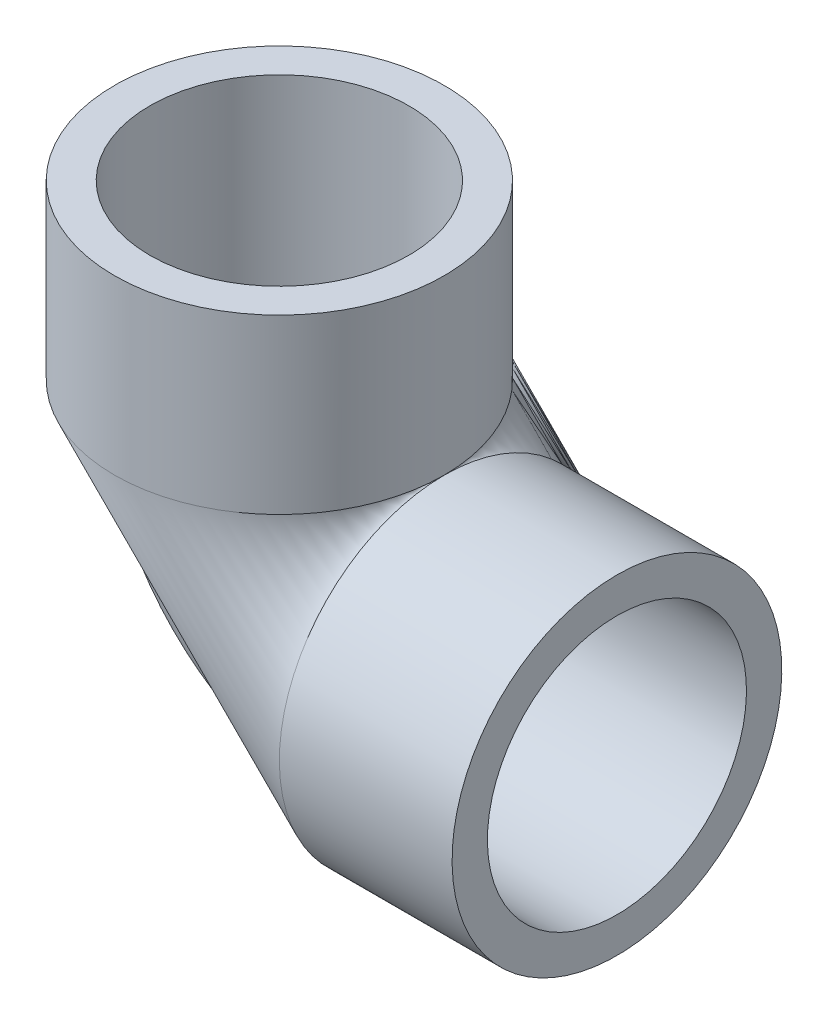
ISO-10303-21;
HEADER;
FILE_DESCRIPTION(('STEP AP214'),'2;1');
FILE_NAME('part.step','',(''),(''),'','','');
FILE_SCHEMA(('AUTOMOTIVE_DESIGN { 1 0 10303 214 1 1 1 1 }'));
ENDSEC;
DATA;
#1=APPLICATION_CONTEXT('core data for automotive mechanical design processes');
#2=APPLICATION_PROTOCOL_DEFINITION('international standard','automotive_design',2000,#1);
#3=PRODUCT_CONTEXT('',#1,'mechanical');
#4=PRODUCT('Part','Part','',(#3));
#5=PRODUCT_RELATED_PRODUCT_CATEGORY('part','',(#4));
#6=PRODUCT_DEFINITION_FORMATION('','',#4);
#7=PRODUCT_DEFINITION_CONTEXT('part definition',#1,'design');
#8=PRODUCT_DEFINITION('design','',#6,#7);
#9=PRODUCT_DEFINITION_SHAPE('','',#8);
#10=(LENGTH_UNIT() NAMED_UNIT(*) SI_UNIT(.MILLI.,.METRE.));
#11=(NAMED_UNIT(*) PLANE_ANGLE_UNIT() SI_UNIT($,.RADIAN.));
#12=(NAMED_UNIT(*) SI_UNIT($,.STERADIAN.) SOLID_ANGLE_UNIT());
#13=UNCERTAINTY_MEASURE_WITH_UNIT(LENGTH_MEASURE(1.E-05),#10,'distance_accuracy_value','');
#14=(GEOMETRIC_REPRESENTATION_CONTEXT(3) GLOBAL_UNCERTAINTY_ASSIGNED_CONTEXT((#13)) GLOBAL_UNIT_ASSIGNED_CONTEXT((#10,
#11,#12)) REPRESENTATION_CONTEXT('',''));
#15=CARTESIAN_POINT('',(0.,0.,0.));
#16=DIRECTION('',(0.,0.,1.));
#17=DIRECTION('',(1.,0.,0.));
#18=AXIS2_PLACEMENT_3D('',#15,#16,#17);
#19=CARTESIAN_POINT('',(16.66875,-17.4625,0.));
#20=DIRECTION('',(0.,0.,1.));
#21=DIRECTION('',(1.,0.,0.));
#22=AXIS2_PLACEMENT_3D('',#19,#20,#21);
#23=TOROIDAL_SURFACE('',#22,16.66875,12.7);
#24=CARTESIAN_POINT('',(15.08125,-43.0626561830387,-8.9799317743288));
#25=CARTESIAN_POINT('',(15.08125,-42.809587008464,-9.23253720698957));
#26=CARTESIAN_POINT('',(15.08125,-42.5458718412618,-9.47442334524002));
#27=CARTESIAN_POINT('',(15.08125,-41.9989016005629,-9.93518223296435));
#28=CARTESIAN_POINT('',(15.08125,-41.7156411904807,-10.1540486556861));
#29=CARTESIAN_POINT('',(15.08125,-41.1313614668476,-10.5673577395072));
#30=CARTESIAN_POINT('',(15.08125,-40.8303226990876,-10.7617728884659));
#31=CARTESIAN_POINT('',(15.08125,-40.2129249938863,-11.1245294798165));
#32=CARTESIAN_POINT('',(15.08125,-39.8965660753375,-11.2928709543608));
#33=CARTESIAN_POINT('',(15.08125,-39.2509901428096,-11.6022051928326));
#34=CARTESIAN_POINT('',(15.08125,-38.9217811821697,-11.7432147657227));
#35=CARTESIAN_POINT('',(15.08125,-38.2526626394665,-11.9970398339399));
#36=CARTESIAN_POINT('',(15.08125,-37.9127528876756,-12.1098548818135));
#37=CARTESIAN_POINT('',(15.08125,-37.2247491891379,-12.3064902637684));
#38=CARTESIAN_POINT('',(15.08125,-36.8766575029687,-12.3903185083149));
#39=CARTESIAN_POINT('',(15.08125,-36.1746687416269,-12.5284644774771));
#40=CARTESIAN_POINT('',(15.08125,-35.8207716788133,-12.5827822649083));
#41=CARTESIAN_POINT('',(15.08125,-35.1087916178865,-12.6616620589225));
#42=CARTESIAN_POINT('',(15.08125,-34.750700435262,-12.6861501838495));
#43=CARTESIAN_POINT('',(15.08125,-34.0337271470964,-12.7049994763203));
#44=CARTESIAN_POINT('',(15.08125,-33.6748450402634,-12.6993605946173));
#45=CARTESIAN_POINT('',(15.08125,-32.95879051547,-12.6580487120037));
#46=CARTESIAN_POINT('',(15.08125,-32.6016182158085,-12.6223736622985));
#47=CARTESIAN_POINT('',(15.08125,-31.8915054022052,-12.5212998109258));
#48=CARTESIAN_POINT('',(15.08125,-31.538564905032,-12.4559008915168));
#49=CARTESIAN_POINT('',(15.08125,-30.8373404175716,-12.2954431849074));
#50=CARTESIAN_POINT('',(15.08125,-30.4890952277944,-12.2002148353084));
#51=CARTESIAN_POINT('',(15.08125,-29.8017892690921,-11.9809730397868));
#52=CARTESIAN_POINT('',(15.08125,-29.4627285232792,-11.8569595214358));
#53=CARTESIAN_POINT('',(15.08125,-28.7961408578277,-11.581109046127));
#54=CARTESIAN_POINT('',(15.08125,-28.468613431296,-11.4292733137888));
#55=CARTESIAN_POINT('',(15.08125,-27.8273026625447,-11.0989236809953));
#56=CARTESIAN_POINT('',(15.08125,-27.5135194170695,-10.9204095927918));
#57=CARTESIAN_POINT('',(15.08125,-26.8986564275992,-10.5360647249099));
#58=CARTESIAN_POINT('',(15.08125,-26.597740370763,-10.32997207491));
#59=CARTESIAN_POINT('',(15.08125,-26.0141144966661,-9.89344849600062));
#60=CARTESIAN_POINT('',(15.08125,-25.7314048039978,-9.66301740056342));
#61=CARTESIAN_POINT('',(15.08125,-25.1860588979013,-9.17948339048945));
#62=CARTESIAN_POINT('',(15.08125,-24.9234239901319,-8.92637900350908));
#63=CARTESIAN_POINT('',(15.08125,-24.4198972289138,-8.39921436303733));
#64=CARTESIAN_POINT('',(15.08125,-24.1790137018831,-8.12514615813704));
#65=CARTESIAN_POINT('',(15.08125,-23.7174185998298,-7.55394079906333));
#66=CARTESIAN_POINT('',(15.08125,-23.497048093995,-7.25652792282));
#67=CARTESIAN_POINT('',(15.08125,-23.0820831202526,-6.64423380267808));
#68=CARTESIAN_POINT('',(15.08125,-22.8874884345808,-6.32935270638958));
#69=CARTESIAN_POINT('',(15.08125,-22.5256343936779,-5.68419356779112));
#70=CARTESIAN_POINT('',(15.08125,-22.3583785179188,-5.35391357249282));
#71=CARTESIAN_POINT('',(15.08125,-22.0528448437,-4.68013943111232));
#72=CARTESIAN_POINT('',(15.08125,-21.9145708931291,-4.33664353753058));
#73=CARTESIAN_POINT('',(15.08125,-21.6695664357953,-3.64110699955026));
#74=CARTESIAN_POINT('',(15.08125,-21.5626336565383,-3.28913776115465));
#75=CARTESIAN_POINT('',(15.08125,-21.3808720079995,-2.57716169280524));
#76=CARTESIAN_POINT('',(15.08125,-21.3060270698222,-2.21715898109142));
#77=CARTESIAN_POINT('',(15.08125,-21.1899769663406,-1.49207553894225));
#78=CARTESIAN_POINT('',(15.08125,-21.1487419960512,-1.1269996002809));
#79=CARTESIAN_POINT('',(15.08125,-21.1008420470706,-0.394598453556225));
#80=CARTESIAN_POINT('',(15.08125,-21.0941737505169,-0.0272734647553036));
#81=CARTESIAN_POINT('',(15.08125,-21.1146927222672,0.676257441163889));
#82=CARTESIAN_POINT('',(15.08125,-21.1391500335384,1.01254643867464));
#83=CARTESIAN_POINT('',(15.08125,-21.2167844936315,1.68177510969918));
#84=CARTESIAN_POINT('',(15.08125,-21.2699607483635,2.01471488715358));
#85=CARTESIAN_POINT('',(15.08125,-21.4040310162699,2.67511092727373));
#86=CARTESIAN_POINT('',(15.08125,-21.484938466339,3.00256445079884));
#87=CARTESIAN_POINT('',(15.08125,-21.6732145716112,3.64988968270588));
#88=CARTESIAN_POINT('',(15.08125,-21.780593401426,3.96975842383695));
#89=CARTESIAN_POINT('',(15.08125,-22.0210429610087,4.60145317329528));
#90=CARTESIAN_POINT('',(15.08125,-22.1542359505165,4.91323256892134));
#91=CARTESIAN_POINT('',(15.08125,-22.4446640736736,5.52536255521346));
#92=CARTESIAN_POINT('',(15.08125,-22.6018986406503,5.8257134150477));
#93=CARTESIAN_POINT('',(15.08125,-22.9391902081227,6.41336188266581));
#94=CARTESIAN_POINT('',(15.08125,-23.119250198626,6.70065777360897));
#95=CARTESIAN_POINT('',(15.08125,-23.5009005432906,7.26044970458331));
#96=CARTESIAN_POINT('',(15.08125,-23.7024851108321,7.5329496927437));
#97=CARTESIAN_POINT('',(15.08125,-24.1433565636834,8.0833342574544));
#98=CARTESIAN_POINT('',(15.08125,-24.3843792392686,8.35983099168014));
#99=CARTESIAN_POINT('',(15.08125,-24.8885961963402,8.8918277649966));
#100=CARTESIAN_POINT('',(15.08125,-25.1517915751838,9.14732676364304));
#101=CARTESIAN_POINT('',(15.08125,-25.6986119759426,9.6355101202471));
#102=CARTESIAN_POINT('',(15.08125,-25.9822392624644,9.86819194245294));
#103=CARTESIAN_POINT('',(15.08125,-26.5679807153731,10.3089873660632));
#104=CARTESIAN_POINT('',(15.08125,-26.8700947153243,10.5171011886037));
#105=CARTESIAN_POINT('',(15.08125,-27.4937520578878,10.9090801073777));
#106=CARTESIAN_POINT('',(15.08125,-27.8154548358405,11.0926916657536));
#107=CARTESIAN_POINT('',(15.08125,-28.4733427436701,11.431837077057));
#108=CARTESIAN_POINT('',(15.08125,-28.8095280577718,11.5873705726876));
#109=CARTESIAN_POINT('',(15.08125,-29.493964127133,11.8691153606071));
#110=CARTESIAN_POINT('',(15.08125,-29.8422146377745,11.9953272469827));
#111=CARTESIAN_POINT('',(15.08125,-30.5482590695898,12.2174067869833));
#112=CARTESIAN_POINT('',(15.08125,-30.9060528557442,12.3132748696689));
#113=CARTESIAN_POINT('',(15.08125,-31.6234300704678,12.4727318779431));
#114=CARTESIAN_POINT('',(15.08125,-31.9829159803262,12.5367597384026));
#115=CARTESIAN_POINT('',(15.08125,-32.7060306213315,12.6340187391734));
#116=CARTESIAN_POINT('',(15.08125,-33.0696593199472,12.6672501211442));
#117=CARTESIAN_POINT('',(15.08125,-33.7984068824514,12.7026090438298));
#118=CARTESIAN_POINT('',(15.08125,-34.1635256634836,12.7047382910314));
#119=CARTESIAN_POINT('',(15.08125,-34.8926131111404,12.6778251595594));
#120=CARTESIAN_POINT('',(15.08125,-35.256581784579,12.6487829659135));
#121=CARTESIAN_POINT('',(15.08125,-35.976810637392,12.5601708237403));
#122=CARTESIAN_POINT('',(15.08125,-36.3331116223972,12.5009322834569));
#123=CARTESIAN_POINT('',(15.08125,-37.039417167778,12.3524969973218));
#124=CARTESIAN_POINT('',(15.08125,-37.3894217745538,12.2633004723365));
#125=CARTESIAN_POINT('',(15.08125,-38.0806011079605,12.0555595844257));
#126=CARTESIAN_POINT('',(15.08125,-38.421776058755,11.9370159673611));
#127=CARTESIAN_POINT('',(15.08125,-39.0928369345746,11.6714056287885));
#128=CARTESIAN_POINT('',(15.08125,-39.4227228877308,11.5243389783631));
#129=CARTESIAN_POINT('',(15.08125,-40.0668752881791,11.203686191107));
#130=CARTESIAN_POINT('',(15.08125,-40.3812235188121,11.0302643254194));
#131=CARTESIAN_POINT('',(15.08125,-40.9941457330656,10.6574853032463));
#132=CARTESIAN_POINT('',(15.08125,-41.2927197844294,10.4581282581538));
#133=CARTESIAN_POINT('',(15.08125,-41.8719441286315,10.0348920819217));
#134=CARTESIAN_POINT('',(15.08125,-42.1525946594305,9.81101327645123));
#135=CARTESIAN_POINT('',(15.08125,-42.6939564474244,9.34032215930848));
#136=CARTESIAN_POINT('',(15.08125,-42.9546677296624,9.09350987644088));
#137=CARTESIAN_POINT('',(15.08125,-43.4534618754714,8.57954696291266));
#138=CARTESIAN_POINT('',(15.08125,-43.6916153844931,8.31246488881601));
#139=CARTESIAN_POINT('',(15.08125,-44.1445398708572,7.75916051079744));
#140=CARTESIAN_POINT('',(15.08125,-44.3593109029295,7.47293825167836));
#141=CARTESIAN_POINT('',(15.08125,-44.7639298500392,6.88339074190881));
#142=CARTESIAN_POINT('',(15.08125,-44.9537779039727,6.58006558658649));
#143=CARTESIAN_POINT('',(15.08125,-45.3071904816392,5.95847137339124));
#144=CARTESIAN_POINT('',(15.08125,-45.4707550229594,5.6402023255179));
#145=CARTESIAN_POINT('',(15.08125,-45.7701701264878,4.99154612740584));
#146=CARTESIAN_POINT('',(15.08125,-45.9060676432381,4.66118065015975));
#147=CARTESIAN_POINT('',(15.08125,-46.1495270041285,3.99016890381088));
#148=CARTESIAN_POINT('',(15.08125,-46.2570888786481,3.64952264573082));
#149=CARTESIAN_POINT('',(15.08125,-46.4431030847105,2.96038915396448));
#150=CARTESIAN_POINT('',(15.08125,-46.5215567093532,2.6119022693185));
#151=CARTESIAN_POINT('',(15.08125,-46.6487995294992,1.90955456110286));
#152=CARTESIAN_POINT('',(15.08125,-46.6975887637502,1.55569374455328));
#153=CARTESIAN_POINT('',(15.08125,-46.765122070229,0.845450999405052));
#154=CARTESIAN_POINT('',(15.08125,-46.7838942106239,0.489071739375971));
#155=CARTESIAN_POINT('',(15.08125,-46.7913470388221,-0.224002552382375));
#156=CARTESIAN_POINT('',(15.08125,-46.7800276252273,-0.580697585171637));
#157=CARTESIAN_POINT('',(15.08125,-46.7273711031264,-1.29195843086824));
#158=CARTESIAN_POINT('',(15.08125,-46.686026187863,-1.64652366584048));
#159=CARTESIAN_POINT('',(15.08125,-46.5736064964687,-2.35090316472964));
#160=CARTESIAN_POINT('',(15.08125,-46.5025322022483,-2.70071750556323));
#161=CARTESIAN_POINT('',(15.08125,-46.3311348279911,-3.39322180932631));
#162=CARTESIAN_POINT('',(15.08125,-46.2308026455208,-3.73590951948788));
#163=CARTESIAN_POINT('',(15.08125,-46.0016162107847,-4.4116105683407));
#164=CARTESIAN_POINT('',(15.08125,-45.8727618551343,-4.74462387196005));
#165=CARTESIAN_POINT('',(15.08125,-45.5876057739772,-5.39825180099275));
#166=CARTESIAN_POINT('',(15.08125,-45.431334497108,-5.71887970432928));
#167=CARTESIAN_POINT('',(15.08125,-45.0924245878567,-6.34574750429641));
#168=CARTESIAN_POINT('',(15.08125,-44.9097930930489,-6.65199126607475));
#169=CARTESIAN_POINT('',(15.08125,-44.4751902699158,-7.31554718286444));
#170=CARTESIAN_POINT('',(15.08125,-44.2168805071797,-7.66873086755303));
#171=CARTESIAN_POINT('',(15.08125,-43.6652311992463,-8.34658875251484));
#172=CARTESIAN_POINT('',(15.08125,-43.3718916626315,-8.67126295977298));
#173=CARTESIAN_POINT('',(15.08125,-43.0626561830387,-8.9799317743288));
#174=B_SPLINE_CURVE_WITH_KNOTS('',3,(#24,#25,#26,#27,#28,#29,#30,#31,#32,#33,#34,#35,#36,#37,
#38,#39,#40,#41,#42,#43,#44,#45,#46,#47,#48,#49,#50,#51,#52,#53,#54,#55,#56,#57,#58,#59,#60,#61,
#62,#63,#64,#65,#66,#67,#68,#69,#70,#71,#72,#73,#74,#75,#76,#77,#78,#79,#80,#81,#82,#83,#84,#85,
#86,#87,#88,#89,#90,#91,#92,#93,#94,#95,#96,#97,#98,#99,#100,#101,#102,#103,#104,#105,#106,#107,
#108,#109,#110,#111,#112,#113,#114,#115,#116,#117,#118,#119,#120,#121,#122,#123,#124,#125,#126,
#127,#128,#129,#130,#131,#132,#133,#134,#135,#136,#137,#138,#139,#140,#141,#142,#143,#144,#145,
#146,#147,#148,#149,#150,#151,#152,#153,#154,#155,#156,#157,#158,#159,#160,#161,#162,#163,#164,
#165,#166,#167,#168,#169,#170,#171,#172,#173),.UNSPECIFIED.,.T.,.F.,(4,2,2,2,2,2,2,2,2,2,2,2,2,
2,2,2,2,2,2,2,2,2,2,2,2,2,2,2,2,2,2,2,2,2,2,2,2,2,2,2,2,2,2,2,2,2,2,2,2,2,2,2,2,2,2,2,2,2,2,2,2,
2,2,2,2,2,2,2,2,2,2,2,2,2,4),(0.,1.07231469434645,2.14492333837258,3.21872826595101,
4.29253186937444,5.36567297973922,6.43883112001269,7.5116961651099,8.58455892651692,
9.66007357031691,10.7355899722045,11.8111797420046,12.886773772447,13.9685963930682,
15.0504217357705,16.1321994723966,17.2139848223651,18.3068872575674,19.3997971710808,
20.4927781067927,21.5861756769444,22.6953441196067,23.8045031909929,24.9138033178343,
26.0232506317083,27.1253715248369,28.2269398531896,29.3275302556395,30.4280150165911,
31.4383057653313,32.4485650630996,33.4593145663247,34.4704531713658,35.4865031759383,
36.5025292353753,37.5186885265579,38.5345753202629,39.6336895457362,40.7328581998634,
41.8321488702965,42.9314296452836,44.0413246076011,45.1512336924731,46.261120287453,
47.3709911879644,48.4651056136359,49.55921145373,50.6532572630813,51.7472965784215,
52.8295792314294,53.911853905439,54.9941010760984,56.0763455497178,57.152101920158,
58.2278536703209,59.3035911353555,60.3793272492725,61.4515745761607,62.5238193932482,
63.5960582344466,64.6682963581755,65.7386992995558,66.8091010933258,67.8794553300538,
68.9498081686745,70.019159562986,71.0885145606462,72.1581476947105,73.2277634907877,
74.2977124111375,75.3676652098077,76.4364371783146,77.5049202957084,78.8152253954139,
80.125530174089),.UNSPECIFIED.);
#175=CARTESIAN_POINT('',(15.08125,-43.0626561830387,-8.9799317743288));
#176=VERTEX_POINT('',#175);
#177=EDGE_CURVE('E67',#176,#176,#174,.T.);
#178=ORIENTED_EDGE('',*,*,#177,.T.);
#179=EDGE_LOOP('',(#178));
#180=FACE_BOUND('',#179,.T.);
#181=CARTESIAN_POINT('',(-8.93140618303871,-19.05,-8.9799317743288));
#182=CARTESIAN_POINT('',(-9.18377655851256,-19.05,-8.72803058562184));
#183=CARTESIAN_POINT('',(-9.42550426574209,-19.05,-8.4655247184167));
#184=CARTESIAN_POINT('',(-9.88609416289693,-19.05,-7.92101907520552));
#185=CARTESIAN_POINT('',(-10.1049502939297,-19.05,-7.63901416643247));
#186=CARTESIAN_POINT('',(-10.5183650082129,-19.05,-7.05726989543121));
#187=CARTESIAN_POINT('',(-10.7128970261296,-19.05,-6.75751166142437));
#188=CARTESIAN_POINT('',(-11.0759999560165,-19.05,-6.14266351552761));
#189=CARTESIAN_POINT('',(-11.24457097841,-19.05,-5.82757366885699));
#190=CARTESIAN_POINT('',(-11.5544752415421,-19.05,-5.18444756153387));
#191=CARTESIAN_POINT('',(-11.6958207021166,-19.05,-4.85641718909321));
#192=CARTESIAN_POINT('',(-11.9503595258257,-19.05,-4.18960366614805));
#193=CARTESIAN_POINT('',(-12.0635524383955,-19.05,-3.85082034364682));
#194=CARTESIAN_POINT('',(-12.2609478272341,-19.05,-3.16500475735214));
#195=CARTESIAN_POINT('',(-12.3451577287143,-19.05,-2.81797463071503));
#196=CARTESIAN_POINT('',(-12.4840246532319,-19.05,-2.11805242775199));
#197=CARTESIAN_POINT('',(-12.5386818059348,-19.05,-1.76516037715278));
#198=CARTESIAN_POINT('',(-12.618032974182,-19.05,-1.05620154645754));
#199=CARTESIAN_POINT('',(-12.6427418974862,-19.05,-0.700136434856871));
#200=CARTESIAN_POINT('',(-12.662069630044,-19.05,0.0128097973694288));
#201=CARTESIAN_POINT('',(-12.6566884209404,-19.05,0.369690918492751));
#202=CARTESIAN_POINT('',(-12.6158735467521,-19.05,1.08174364455728));
#203=CARTESIAN_POINT('',(-12.5804387780361,-19.05,1.43691518623735));
#204=CARTESIAN_POINT('',(-12.4797686268837,-19.05,2.14300938900405));
#205=CARTESIAN_POINT('',(-12.4145332511711,-19.05,2.49393205104931));
#206=CARTESIAN_POINT('',(-12.2547467729892,-19.05,3.18895233515215));
#207=CARTESIAN_POINT('',(-12.1602024940841,-19.05,3.53305152599984));
#208=CARTESIAN_POINT('',(-11.94246859292,-19.05,4.21206422980923));
#209=CARTESIAN_POINT('',(-11.8192789776879,-19.05,4.54697774502425));
#210=CARTESIAN_POINT('',(-11.5451344112598,-19.05,5.20524034413199));
#211=CARTESIAN_POINT('',(-11.3941795269215,-19.05,5.52858945586918));
#212=CARTESIAN_POINT('',(-11.0655817923949,-19.05,6.16143004978112));
#213=CARTESIAN_POINT('',(-10.887938932516,-19.05,6.47092152692405));
#214=CARTESIAN_POINT('',(-10.5071620746857,-19.05,7.07396519685729));
#215=CARTESIAN_POINT('',(-10.3040186362183,-19.05,7.36751142862999));
#216=CARTESIAN_POINT('',(-9.87374234269406,-19.05,7.93646117824479));
#217=CARTESIAN_POINT('',(-9.64660948669624,-19.05,8.21186469537518));
#218=CARTESIAN_POINT('',(-9.16997453426334,-19.05,8.74258118195283));
#219=CARTESIAN_POINT('',(-8.92047245704205,-19.05,8.99789416865627));
#220=CARTESIAN_POINT('',(-8.40087697372423,-19.05,9.4866282703136));
#221=CARTESIAN_POINT('',(-8.13078355114896,-19.05,9.72004936774762));
#222=CARTESIAN_POINT('',(-7.57163120649285,-19.05,10.1635927204243));
#223=CARTESIAN_POINT('',(-7.28255242919366,-19.05,10.3736899451232));
#224=CARTESIAN_POINT('',(-6.68774728337331,-19.05,10.7688234055521));
#225=CARTESIAN_POINT('',(-6.38202090880456,-19.05,10.9538596321781));
#226=CARTESIAN_POINT('',(-5.75609495686129,-19.05,11.2975783282554));
#227=CARTESIAN_POINT('',(-5.43589530874412,-19.05,11.4562606688761));
#228=CARTESIAN_POINT('',(-4.78329925633283,-19.05,11.7461689915897));
#229=CARTESIAN_POINT('',(-4.45090283388825,-19.05,11.8773949328218));
#230=CARTESIAN_POINT('',(-3.77556180724053,-19.05,12.1117345182332));
#231=CARTESIAN_POINT('',(-3.43259652353178,-19.05,12.2147885660714));
#232=CARTESIAN_POINT('',(-2.73922172995929,-19.05,12.3917199108647));
#233=CARTESIAN_POINT('',(-2.38881221421345,-19.05,12.4655971847647));
#234=CARTESIAN_POINT('',(-1.68303142005261,-19.05,12.5836889939977));
#235=CARTESIAN_POINT('',(-1.32766014800485,-19.05,12.6279035673921));
#236=CARTESIAN_POINT('',(-0.614463275772074,-19.05,12.6864009673101));
#237=CARTESIAN_POINT('',(-0.256637669064627,-19.05,12.7006837142587));
#238=CARTESIAN_POINT('',(0.460335017235472,-19.05,12.699263247836));
#239=CARTESIAN_POINT('',(0.819481866848438,-19.05,12.6834440882457));
#240=CARTESIAN_POINT('',(1.53518436512965,-19.05,12.6217596678616));
#241=CARTESIAN_POINT('',(1.89174000978895,-19.05,12.5758943605923));
#242=CARTESIAN_POINT('',(2.59977783503168,-19.05,12.4545035005301));
#243=CARTESIAN_POINT('',(2.95125982830334,-19.05,12.3789768555729));
#244=CARTESIAN_POINT('',(3.64669696437696,-19.05,12.1988660547886));
#245=CARTESIAN_POINT('',(3.99065207034096,-19.05,12.0942817567824));
#246=CARTESIAN_POINT('',(4.67108070045168,-19.05,11.8560210500092));
#247=CARTESIAN_POINT('',(5.00748365930726,-19.05,11.7221431199016));
#248=CARTESIAN_POINT('',(5.66793438068032,-19.05,11.426767478771));
#249=CARTESIAN_POINT('',(5.99198210114088,-19.05,11.2652696737409));
#250=CARTESIAN_POINT('',(6.62549376619051,-19.05,10.9158890087616));
#251=CARTESIAN_POINT('',(6.9349587455347,-19.05,10.7280080246739));
#252=CARTESIAN_POINT('',(7.53725442398791,-19.05,10.3272491721639));
#253=CARTESIAN_POINT('',(7.83008498376389,-19.05,10.1143710944068));
#254=CARTESIAN_POINT('',(8.40059154830698,-19.05,9.66246300766764));
#255=CARTESIAN_POINT('',(8.67804247831772,-19.05,9.42314883263376));
#256=CARTESIAN_POINT('',(9.21206029327134,-19.05,8.92225569828442));
#257=CARTESIAN_POINT('',(9.46862696612415,-19.05,8.66067651291183));
#258=CARTESIAN_POINT('',(9.95923828064997,-19.05,8.11702000509644));
#259=CARTESIAN_POINT('',(10.1932749293144,-19.05,7.83493546977812));
#260=CARTESIAN_POINT('',(10.6371873856637,-19.05,7.25219903385487));
#261=CARTESIAN_POINT('',(10.8470546463709,-19.05,6.95154062239776));
#262=CARTESIAN_POINT('',(11.2435793307944,-19.05,6.32969207843763));
#263=CARTESIAN_POINT('',(11.4298948505158,-19.05,6.00828376701514));
#264=CARTESIAN_POINT('',(11.7744324116949,-19.05,5.35071607925152));
#265=CARTESIAN_POINT('',(11.9326532015458,-19.05,5.0145560465598));
#266=CARTESIAN_POINT('',(12.2192645389604,-19.05,4.32986259926341));
#267=CARTESIAN_POINT('',(12.3476650474487,-19.05,3.98133336134263));
#268=CARTESIAN_POINT('',(12.5728817244962,-19.05,3.27436668584835));
#269=CARTESIAN_POINT('',(12.6697130107145,-19.05,2.91593408020116));
#270=CARTESIAN_POINT('',(12.8276501899388,-19.05,2.20283583577177));
#271=CARTESIAN_POINT('',(12.8897642046448,-19.05,1.84839397499728));
#272=CARTESIAN_POINT('',(12.9814173052444,-19.05,1.13531716041021));
#273=CARTESIAN_POINT('',(13.0109581519017,-19.05,0.776682434304889));
#274=CARTESIAN_POINT('',(13.036723224979,-19.05,0.0584019428271621));
#275=CARTESIAN_POINT('',(13.0329648407828,-19.05,-0.301243196804213));
#276=CARTESIAN_POINT('',(12.992269385328,-19.05,-1.01864027509296));
#277=CARTESIAN_POINT('',(12.9553331365591,-19.05,-1.37639226046106));
#278=CARTESIAN_POINT('',(12.8534624200171,-19.05,-2.05845193294635));
#279=CARTESIAN_POINT('',(12.7910178929441,-19.05,-2.38313588894335));
#280=CARTESIAN_POINT('',(12.6399097523714,-19.05,-3.02645461654499));
#281=CARTESIAN_POINT('',(12.551236774496,-19.05,-3.34508718430164));
#282=CARTESIAN_POINT('',(12.3488806299167,-19.05,-3.97444297883396));
#283=CARTESIAN_POINT('',(12.2351865721121,-19.05,-4.28516269541211));
#284=CARTESIAN_POINT('',(11.9840731348122,-19.05,-4.89681828025962));
#285=CARTESIAN_POINT('',(11.8466554361327,-19.05,-5.19775483987023));
#286=CARTESIAN_POINT('',(11.5407546128659,-19.05,-5.80520139100137));
#287=CARTESIAN_POINT('',(11.3709425958577,-19.05,-6.1110426297117));
#288=CARTESIAN_POINT('',(11.0074720574254,-19.05,-6.70821476516885));
#289=CARTESIAN_POINT('',(10.8138125672485,-19.05,-6.99954507176436));
#290=CARTESIAN_POINT('',(10.4039703398519,-19.05,-7.56594781349016));
#291=CARTESIAN_POINT('',(10.1877855799655,-19.05,-7.8410187851243));
#292=CARTESIAN_POINT('',(9.73436783320529,-19.05,-8.37306496997756));
#293=CARTESIAN_POINT('',(9.49714181411287,-19.05,-8.63004612342487));
#294=CARTESIAN_POINT('',(8.98848903835837,-19.05,-9.13891813845278));
#295=CARTESIAN_POINT('',(8.71587132039425,-19.05,-9.38962033776576));
#296=CARTESIAN_POINT('',(8.15045760094572,-19.05,-9.86715326767908));
#297=CARTESIAN_POINT('',(7.85766076219911,-19.05,-10.093983006787));
#298=CARTESIAN_POINT('',(7.25387628937398,-19.05,-10.5220715830146));
#299=CARTESIAN_POINT('',(6.94288646600965,-19.05,-10.7233273333599));
#300=CARTESIAN_POINT('',(6.30492706967534,-19.05,-11.0986746060564));
#301=CARTESIAN_POINT('',(5.97795774505946,-19.05,-11.2727665504123));
#302=CARTESIAN_POINT('',(5.31183727756584,-19.05,-11.5917085702226));
#303=CARTESIAN_POINT('',(4.97274664234968,-19.05,-11.7366850010449));
#304=CARTESIAN_POINT('',(4.2834376048409,-19.05,-11.9972071834127));
#305=CARTESIAN_POINT('',(3.93321917951292,-19.05,-12.11275287403));
#306=CARTESIAN_POINT('',(3.22422002894666,-19.05,-12.3134662053024));
#307=CARTESIAN_POINT('',(2.86544019485937,-19.05,-12.3986369930711));
#308=CARTESIAN_POINT('',(2.14190052580615,-19.05,-12.5379078424655));
#309=CARTESIAN_POINT('',(1.77714076313002,-19.05,-12.5920082794083));
#310=CARTESIAN_POINT('',(1.04950033956516,-19.05,-12.6681258415884));
#311=CARTESIAN_POINT('',(0.686665900360883,-19.05,-12.6905853088299));
#312=CARTESIAN_POINT('',(-0.0396012949861982,-19.05,-12.7046250849358));
#313=CARTESIAN_POINT('',(-0.403034048325633,-19.05,-12.6962055380727));
#314=CARTESIAN_POINT('',(-1.12794926969466,-19.05,-12.6484897830578));
#315=CARTESIAN_POINT('',(-1.4894312846266,-19.05,-12.6091866882085));
#316=CARTESIAN_POINT('',(-2.20772890869946,-19.05,-12.499936117208));
#317=CARTESIAN_POINT('',(-2.56454461375152,-19.05,-12.4299892719296));
#318=CARTESIAN_POINT('',(-3.26792814362072,-19.05,-12.2606405902193));
#319=CARTESIAN_POINT('',(-3.61455705052542,-19.05,-12.1614923890261));
#320=CARTESIAN_POINT('',(-4.29817738690467,-19.05,-11.9342107491354));
#321=CARTESIAN_POINT('',(-4.63516884663767,-19.05,-11.8060774014531));
#322=CARTESIAN_POINT('',(-5.29671626339223,-19.05,-11.5218750307158));
#323=CARTESIAN_POINT('',(-5.62128576743064,-19.05,-11.3658375577817));
#324=CARTESIAN_POINT('',(-6.25594007311546,-19.05,-11.0268920318417));
#325=CARTESIAN_POINT('',(-6.56602878734342,-19.05,-10.8439912930653));
#326=CARTESIAN_POINT('',(-7.23954996469399,-19.05,-10.4071915764425));
#327=CARTESIAN_POINT('',(-7.59870559398474,-19.05,-10.1466597159203));
#328=CARTESIAN_POINT('',(-8.28785261980269,-19.05,-9.58951934535046));
#329=CARTESIAN_POINT('',(-8.61784408616473,-19.05,-9.29291092169386));
#330=CARTESIAN_POINT('',(-8.93140618303871,-19.05,-8.9799317743288));
#331=B_SPLINE_CURVE_WITH_KNOTS('',3,(#181,#182,#183,#184,#185,#186,#187,#188,#189,#190,#191,
#192,#193,#194,#195,#196,#197,#198,#199,#200,#201,#202,#203,#204,#205,#206,#207,#208,#209,#210,
#211,#212,#213,#214,#215,#216,#217,#218,#219,#220,#221,#222,#223,#224,#225,#226,#227,#228,#229,
#230,#231,#232,#233,#234,#235,#236,#237,#238,#239,#240,#241,#242,#243,#244,#245,#246,#247,#248,
#249,#250,#251,#252,#253,#254,#255,#256,#257,#258,#259,#260,#261,#262,#263,#264,#265,#266,#267,
#268,#269,#270,#271,#272,#273,#274,#275,#276,#277,#278,#279,#280,#281,#282,#283,#284,#285,#286,
#287,#288,#289,#290,#291,#292,#293,#294,#295,#296,#297,#298,#299,#300,#301,#302,#303,#304,#305,
#306,#307,#308,#309,#310,#311,#312,#313,#314,#315,#316,#317,#318,#319,#320,#321,#322,#323,#324,
#325,#326,#327,#328,#329,#330),.UNSPECIFIED.,.T.,.F.,(4,2,2,2,2,2,2,2,2,2,2,2,2,2,2,2,2,2,2,2,2,
2,2,2,2,2,2,2,2,2,2,2,2,2,2,2,2,2,2,2,2,2,2,2,2,2,2,2,2,2,2,2,2,2,2,2,2,2,2,2,2,2,2,2,2,2,2,2,2,
2,2,2,2,2,4),(0.,1.06933547949883,2.13895352160913,3.20972971807189,4.2805013599472,
5.35079127437887,6.42109831706046,7.49113095133311,8.56115889070167,9.63065396786102,
10.7001496974903,11.7696847030045,12.8392194672061,13.9085054140019,14.9777910984927,
16.0470742082126,17.1163577061946,18.1860382353358,19.2557188064389,20.3253984587606,
21.3950789671287,22.4658965510863,23.5367145240428,24.6075377315217,25.6783625325954,
26.7514353862323,27.8245090877979,28.8975814124552,29.9706565899221,31.0478733956303,
32.1250918675819,33.202350007669,34.2796134188754,35.3645347442233,36.449459762288,
37.5343076804847,38.6191646842331,39.7170914131901,40.8150292907514,41.9133552607916,
43.0120684449507,44.1252451512247,45.2384714365569,46.3513253322677,47.4636455264585,
48.541719802292,49.6197357992635,50.6971888724638,51.7746152360059,52.7654126445305,
53.7565642265241,54.7481480903213,55.7396617293838,56.7879907617859,57.836362394377,
58.8848282472296,59.9329481892748,61.0427229930205,62.1525438707535,63.2624985766194,
64.3724360370038,65.4774472406129,66.5824607318268,67.6873597004096,68.7922453219905,
69.8815259128131,70.97080141432,72.0603198814436,73.1498159193443,74.230114741934,
75.3104101723657,76.3894917893319,77.4682801407926,78.7968983571944,80.1255133920766),.UNSPECIFIED.);
#332=CARTESIAN_POINT('',(-8.93140618303871,-19.05,-8.9799317743288));
#333=VERTEX_POINT('',#332);
#334=EDGE_CURVE('E38',#333,#333,#331,.T.);
#335=ORIENTED_EDGE('',*,*,#334,.T.);
#336=EDGE_LOOP('',(#335));
#337=FACE_BOUND('',#336,.T.);
#338=ADVANCED_FACE('F34',(#180,#337),#23,.F.);
#339=CARTESIAN_POINT('',(16.66875,-34.13125,0.));
#340=DIRECTION('',(1.,0.,0.));
#341=DIRECTION('',(0.,1.,0.));
#342=AXIS2_PLACEMENT_3D('',#339,#340,#341);
#343=CYLINDRICAL_SURFACE('',#342,16.66875);
#344=CARTESIAN_POINT('',(16.66875,-34.13125,0.));
#345=DIRECTION('',(-1.,0.,0.));
#346=DIRECTION('',(0.,0.,1.));
#347=AXIS2_PLACEMENT_3D('',#344,#345,#346);
#348=CIRCLE('',#347,16.66875);
#349=CARTESIAN_POINT('',(16.66875,-17.4625,0.));
#350=VERTEX_POINT('',#349);
#351=EDGE_CURVE('E56',#350,#350,#348,.T.);
#352=ORIENTED_EDGE('',*,*,#351,.F.);
#353=DIRECTION('',(1.,0.,0.));
#354=VECTOR('',#353,1.);
#355=CARTESIAN_POINT('',(16.66875,-17.4625,0.));
#356=LINE('',#355,#354);
#357=CARTESIAN_POINT('',(34.13125,-17.4625,0.));
#358=VERTEX_POINT('',#357);
#359=EDGE_CURVE('E11',#350,#358,#356,.T.);
#360=ORIENTED_EDGE('',*,*,#359,.T.);
#361=CARTESIAN_POINT('',(34.13125,-34.13125,0.));
#362=DIRECTION('',(-1.,0.,0.));
#363=DIRECTION('',(0.,0.,1.));
#364=AXIS2_PLACEMENT_3D('',#361,#362,#363);
#365=CIRCLE('',#364,16.66875);
#366=EDGE_CURVE('E47',#358,#358,#365,.T.);
#367=ORIENTED_EDGE('',*,*,#366,.T.);
#368=ORIENTED_EDGE('',*,*,#359,.F.);
#369=EDGE_LOOP('',(#352,#360,#367,#368));
#370=FACE_BOUND('',#369,.T.);
#371=ADVANCED_FACE('F36',(#370),#343,.T.);
#372=CARTESIAN_POINT('',(16.66875,-17.4625,0.));
#373=DIRECTION('',(0.,0.,1.));
#374=DIRECTION('',(1.,0.,0.));
#375=AXIS2_PLACEMENT_3D('',#372,#373,#374);
#376=DEGENERATE_TOROIDAL_SURFACE('',#375,16.66875,16.66875,.T.);
#377=CARTESIAN_POINT('',(0.,-17.4625,0.));
#378=DIRECTION('',(0.,1.,0.));
#379=DIRECTION('',(0.,0.,1.));
#380=AXIS2_PLACEMENT_3D('',#377,#378,#379);
#381=CIRCLE('',#380,16.66875);
#382=EDGE_CURVE('E60',#350,#350,#381,.T.);
#383=ORIENTED_EDGE('',*,*,#382,.F.);
#384=ORIENTED_EDGE('',*,*,#351,.T.);
#385=EDGE_LOOP('',(#383,#384));
#386=FACE_BOUND('',#385,.T.);
#387=ADVANCED_FACE('F62',(#386),#376,.T.);
#388=CARTESIAN_POINT('',(0.,-17.4625,0.));
#389=DIRECTION('',(0.,1.,0.));
#390=DIRECTION('',(-1.,0.,0.));
#391=AXIS2_PLACEMENT_3D('',#388,#389,#390);
#392=CYLINDRICAL_SURFACE('',#391,16.66875);
#393=ORIENTED_EDGE('',*,*,#382,.T.);
#394=EDGE_LOOP('',(#393));
#395=FACE_BOUND('',#394,.T.);
#396=CARTESIAN_POINT('',(0.,0.,0.));
#397=DIRECTION('',(0.,1.,0.));
#398=DIRECTION('',(0.,0.,1.));
#399=AXIS2_PLACEMENT_3D('',#396,#397,#398);
#400=CIRCLE('',#399,16.66875);
#401=CARTESIAN_POINT('',(0.,0.,16.66875));
#402=VERTEX_POINT('',#401);
#403=EDGE_CURVE('E64',#402,#402,#400,.T.);
#404=ORIENTED_EDGE('',*,*,#403,.F.);
#405=EDGE_LOOP('',(#404));
#406=FACE_BOUND('',#405,.T.);
#407=ADVANCED_FACE('F95',(#395,#406),#392,.T.);
#408=CARTESIAN_POINT('',(34.13125,-34.13125,0.));
#409=DIRECTION('',(-1.,0.,0.));
#410=DIRECTION('',(0.,0.,1.));
#411=AXIS2_PLACEMENT_3D('',#408,#409,#410);
#412=PLANE('',#411);
#413=CARTESIAN_POINT('',(34.13125,-34.13125,0.));
#414=DIRECTION('',(1.,0.,0.));
#415=DIRECTION('',(0.,1.,0.));
#416=AXIS2_PLACEMENT_3D('',#413,#414,#415);
#417=CIRCLE('',#416,13.096875);
#418=CARTESIAN_POINT('',(34.13125,-21.034375,0.));
#419=VERTEX_POINT('',#418);
#420=EDGE_CURVE('E70',#419,#419,#417,.T.);
#421=ORIENTED_EDGE('',*,*,#420,.F.);
#422=EDGE_LOOP('',(#421));
#423=FACE_BOUND('',#422,.T.);
#424=ORIENTED_EDGE('',*,*,#366,.F.);
#425=EDGE_LOOP('',(#424));
#426=FACE_BOUND('',#425,.T.);
#427=ADVANCED_FACE('F92',(#423,#426),#412,.F.);
#428=CARTESIAN_POINT('',(0.,0.,0.));
#429=DIRECTION('',(0.,1.,0.));
#430=DIRECTION('',(0.,0.,1.));
#431=AXIS2_PLACEMENT_3D('',#428,#429,#430);
#432=PLANE('',#431);
#433=CARTESIAN_POINT('',(0.,0.,0.));
#434=DIRECTION('',(0.,1.,0.));
#435=DIRECTION('',(0.,0.,1.));
#436=AXIS2_PLACEMENT_3D('',#433,#434,#435);
#437=CIRCLE('',#436,13.096875);
#438=CARTESIAN_POINT('',(0.,0.,13.096875));
#439=VERTEX_POINT('',#438);
#440=EDGE_CURVE('E117',#439,#439,#437,.T.);
#441=ORIENTED_EDGE('',*,*,#440,.F.);
#442=EDGE_LOOP('',(#441));
#443=FACE_BOUND('',#442,.T.);
#444=ORIENTED_EDGE('',*,*,#403,.T.);
#445=EDGE_LOOP('',(#444));
#446=FACE_BOUND('',#445,.T.);
#447=ADVANCED_FACE('F90',(#443,#446),#432,.T.);
#448=CARTESIAN_POINT('',(15.08125,-34.13125,0.));
#449=DIRECTION('',(1.,0.,0.));
#450=DIRECTION('',(0.,1.,0.));
#451=AXIS2_PLACEMENT_3D('',#448,#449,#450);
#452=CYLINDRICAL_SURFACE('',#451,13.096875);
#453=CARTESIAN_POINT('',(15.08125,-34.13125,0.));
#454=DIRECTION('',(1.,0.,0.));
#455=DIRECTION('',(0.,1.,0.));
#456=AXIS2_PLACEMENT_3D('',#453,#454,#455);
#457=CIRCLE('',#456,13.096875);
#458=CARTESIAN_POINT('',(15.08125,-21.034375,0.));
#459=VERTEX_POINT('',#458);
#460=EDGE_CURVE('E77',#459,#459,#457,.T.);
#461=CARTESIAN_POINT('',(15.08125,-21.034375,0.));
#462=CARTESIAN_POINT('',(15.2796875,-21.034375,0.));
#463=CARTESIAN_POINT('',(15.478125,-21.034375,0.));
#464=CARTESIAN_POINT('',(15.875,-21.034375,0.));
#465=CARTESIAN_POINT('',(16.0734375,-21.034375,0.));
#466=CARTESIAN_POINT('',(16.4703125,-21.034375,0.));
#467=CARTESIAN_POINT('',(16.66875,-21.034375,0.));
#468=CARTESIAN_POINT('',(17.065625,-21.034375,0.));
#469=CARTESIAN_POINT('',(17.2640625,-21.034375,0.));
#470=CARTESIAN_POINT('',(17.6609375,-21.034375,0.));
#471=CARTESIAN_POINT('',(17.859375,-21.034375,0.));
#472=CARTESIAN_POINT('',(18.25625,-21.034375,0.));
#473=CARTESIAN_POINT('',(18.4546875,-21.034375,0.));
#474=CARTESIAN_POINT('',(18.8515625,-21.034375,0.));
#475=CARTESIAN_POINT('',(19.05,-21.034375,0.));
#476=CARTESIAN_POINT('',(19.446875,-21.034375,0.));
#477=CARTESIAN_POINT('',(19.6453125,-21.034375,0.));
#478=CARTESIAN_POINT('',(20.0421875,-21.034375,0.));
#479=CARTESIAN_POINT('',(20.240625,-21.034375,0.));
#480=CARTESIAN_POINT('',(20.6375,-21.034375,0.));
#481=CARTESIAN_POINT('',(20.8359375,-21.034375,0.));
#482=CARTESIAN_POINT('',(21.2328125,-21.034375,0.));
#483=CARTESIAN_POINT('',(21.43125,-21.034375,0.));
#484=CARTESIAN_POINT('',(21.828125,-21.034375,0.));
#485=CARTESIAN_POINT('',(22.0265625,-21.034375,0.));
#486=CARTESIAN_POINT('',(22.4234375,-21.034375,0.));
#487=CARTESIAN_POINT('',(22.621875,-21.034375,0.));
#488=CARTESIAN_POINT('',(23.01875,-21.034375,0.));
#489=CARTESIAN_POINT('',(23.2171875,-21.034375,0.));
#490=CARTESIAN_POINT('',(23.6140625,-21.034375,0.));
#491=CARTESIAN_POINT('',(23.8125,-21.034375,0.));
#492=CARTESIAN_POINT('',(24.209375,-21.034375,0.));
#493=CARTESIAN_POINT('',(24.4078125,-21.034375,0.));
#494=CARTESIAN_POINT('',(24.8046875,-21.034375,0.));
#495=CARTESIAN_POINT('',(25.003125,-21.034375,0.));
#496=CARTESIAN_POINT('',(25.4,-21.034375,0.));
#497=CARTESIAN_POINT('',(25.5984375,-21.034375,0.));
#498=CARTESIAN_POINT('',(25.9953125,-21.034375,0.));
#499=CARTESIAN_POINT('',(26.19375,-21.034375,0.));
#500=CARTESIAN_POINT('',(26.590625,-21.034375,0.));
#501=CARTESIAN_POINT('',(26.7890625,-21.034375,0.));
#502=CARTESIAN_POINT('',(27.1859375,-21.034375,0.));
#503=CARTESIAN_POINT('',(27.384375,-21.034375,0.));
#504=CARTESIAN_POINT('',(27.78125,-21.034375,0.));
#505=CARTESIAN_POINT('',(27.9796875,-21.034375,0.));
#506=CARTESIAN_POINT('',(28.3765625,-21.034375,0.));
#507=CARTESIAN_POINT('',(28.575,-21.034375,0.));
#508=CARTESIAN_POINT('',(28.971875,-21.034375,0.));
#509=CARTESIAN_POINT('',(29.1703125,-21.034375,0.));
#510=CARTESIAN_POINT('',(29.5671875,-21.034375,0.));
#511=CARTESIAN_POINT('',(29.765625,-21.034375,0.));
#512=CARTESIAN_POINT('',(30.1625,-21.034375,0.));
#513=CARTESIAN_POINT('',(30.3609375,-21.034375,0.));
#514=CARTESIAN_POINT('',(30.7578125,-21.034375,0.));
#515=CARTESIAN_POINT('',(30.95625,-21.034375,0.));
#516=CARTESIAN_POINT('',(31.353125,-21.034375,0.));
#517=CARTESIAN_POINT('',(31.5515625,-21.034375,0.));
#518=CARTESIAN_POINT('',(31.9484375,-21.034375,0.));
#519=CARTESIAN_POINT('',(32.146875,-21.034375,0.));
#520=CARTESIAN_POINT('',(32.54375,-21.034375,0.));
#521=CARTESIAN_POINT('',(32.7421875,-21.034375,0.));
#522=CARTESIAN_POINT('',(33.1390625,-21.034375,0.));
#523=CARTESIAN_POINT('',(33.3375,-21.034375,0.));
#524=CARTESIAN_POINT('',(33.734375,-21.034375,0.));
#525=CARTESIAN_POINT('',(33.9328125,-21.034375,0.));
#526=CARTESIAN_POINT('',(34.13125,-21.034375,0.));
#527=B_SPLINE_CURVE_WITH_KNOTS('',3,(#461,#462,#463,#464,#465,#466,#467,#468,#469,#470,#471,
#472,#473,#474,#475,#476,#477,#478,#479,#480,#481,#482,#483,#484,#485,#486,#487,#488,#489,#490,
#491,#492,#493,#494,#495,#496,#497,#498,#499,#500,#501,#502,#503,#504,#505,#506,#507,#508,#509,
#510,#511,#512,#513,#514,#515,#516,#517,#518,#519,#520,#521,#522,#523,#524,#525,#526),
.UNSPECIFIED.,.F.,.F.,(4,2,2,2,2,2,2,2,2,2,2,2,2,2,2,2,2,2,2,2,2,2,2,2,2,2,2,2,2,2,2,2,4),(0.,
0.5953125,1.190625,1.7859375,2.38125,2.9765625,3.571875,4.1671875,4.7625,5.3578125,5.953125,
6.5484375,7.14375,7.7390625,8.334375,8.9296875,9.525,10.1203125,10.715625,11.3109375,11.90625,
12.5015625,13.096875,13.6921875,14.2875,14.8828125,15.478125,16.0734375,16.66875,17.2640625,
17.859375,18.4546875,19.05),.UNSPECIFIED.);
#528=EDGE_CURVE('BSEAM86',#459,#419,#527,.T.);
#529=ORIENTED_EDGE('',*,*,#460,.F.);
#530=ORIENTED_EDGE('',*,*,#420,.T.);
#531=ORIENTED_EDGE('',*,*,#528,.T.);
#532=ORIENTED_EDGE('',*,*,#528,.F.);
#533=EDGE_LOOP('',(#529,#531,#530,#532));
#534=FACE_BOUND('',#533,.T.);
#535=ADVANCED_FACE('F86',(#534),#452,.F.);
#536=CARTESIAN_POINT('',(15.08125,-34.13125,0.));
#537=DIRECTION('',(1.,0.,0.));
#538=DIRECTION('',(0.,1.,0.));
#539=AXIS2_PLACEMENT_3D('',#536,#537,#538);
#540=PLANE('',#539);
#541=ORIENTED_EDGE('',*,*,#177,.F.);
#542=EDGE_LOOP('',(#541));
#543=FACE_BOUND('',#542,.T.);
#544=ORIENTED_EDGE('',*,*,#460,.T.);
#545=EDGE_LOOP('',(#544));
#546=FACE_BOUND('',#545,.T.);
#547=ADVANCED_FACE('F80',(#543,#546),#540,.T.);
#548=CARTESIAN_POINT('',(0.,-19.05,0.));
#549=DIRECTION('',(0.,1.,0.));
#550=DIRECTION('',(0.,0.,1.));
#551=AXIS2_PLACEMENT_3D('',#548,#549,#550);
#552=CYLINDRICAL_SURFACE('',#551,13.096875);
#553=CARTESIAN_POINT('',(0.,-19.05,0.));
#554=DIRECTION('',(0.,1.,0.));
#555=DIRECTION('',(0.,0.,1.));
#556=AXIS2_PLACEMENT_3D('',#553,#554,#555);
#557=CIRCLE('',#556,13.096875);
#558=CARTESIAN_POINT('',(0.,-19.05,13.096875));
#559=VERTEX_POINT('',#558);
#560=EDGE_CURVE('E114',#559,#559,#557,.T.);
#561=CARTESIAN_POINT('',(0.,-19.05,13.096875));
#562=CARTESIAN_POINT('',(0.,-18.8515625,13.096875));
#563=CARTESIAN_POINT('',(0.,-18.653125,13.096875));
#564=CARTESIAN_POINT('',(0.,-18.25625,13.096875));
#565=CARTESIAN_POINT('',(0.,-18.0578125,13.096875));
#566=CARTESIAN_POINT('',(0.,-17.6609375,13.096875));
#567=CARTESIAN_POINT('',(0.,-17.4625,13.096875));
#568=CARTESIAN_POINT('',(0.,-17.065625,13.096875));
#569=CARTESIAN_POINT('',(0.,-16.8671875,13.096875));
#570=CARTESIAN_POINT('',(0.,-16.4703125,13.096875));
#571=CARTESIAN_POINT('',(0.,-16.271875,13.096875));
#572=CARTESIAN_POINT('',(0.,-15.875,13.096875));
#573=CARTESIAN_POINT('',(0.,-15.6765625,13.096875));
#574=CARTESIAN_POINT('',(0.,-15.2796875,13.096875));
#575=CARTESIAN_POINT('',(0.,-15.08125,13.096875));
#576=CARTESIAN_POINT('',(0.,-14.684375,13.096875));
#577=CARTESIAN_POINT('',(0.,-14.4859375,13.096875));
#578=CARTESIAN_POINT('',(0.,-14.0890625,13.096875));
#579=CARTESIAN_POINT('',(0.,-13.890625,13.096875));
#580=CARTESIAN_POINT('',(0.,-13.49375,13.096875));
#581=CARTESIAN_POINT('',(0.,-13.2953125,13.096875));
#582=CARTESIAN_POINT('',(0.,-12.8984375,13.096875));
#583=CARTESIAN_POINT('',(0.,-12.7,13.096875));
#584=CARTESIAN_POINT('',(0.,-12.303125,13.096875));
#585=CARTESIAN_POINT('',(0.,-12.1046875,13.096875));
#586=CARTESIAN_POINT('',(0.,-11.7078125,13.096875));
#587=CARTESIAN_POINT('',(0.,-11.509375,13.096875));
#588=CARTESIAN_POINT('',(0.,-11.1125,13.096875));
#589=CARTESIAN_POINT('',(0.,-10.9140625,13.096875));
#590=CARTESIAN_POINT('',(0.,-10.5171875,13.096875));
#591=CARTESIAN_POINT('',(0.,-10.31875,13.096875));
#592=CARTESIAN_POINT('',(0.,-9.921875,13.096875));
#593=CARTESIAN_POINT('',(0.,-9.7234375,13.096875));
#594=CARTESIAN_POINT('',(0.,-9.3265625,13.096875));
#595=CARTESIAN_POINT('',(0.,-9.128125,13.096875));
#596=CARTESIAN_POINT('',(0.,-8.73125,13.096875));
#597=CARTESIAN_POINT('',(0.,-8.5328125,13.096875));
#598=CARTESIAN_POINT('',(0.,-8.1359375,13.096875));
#599=CARTESIAN_POINT('',(0.,-7.9375,13.096875));
#600=CARTESIAN_POINT('',(0.,-7.540625,13.096875));
#601=CARTESIAN_POINT('',(0.,-7.3421875,13.096875));
#602=CARTESIAN_POINT('',(0.,-6.9453125,13.096875));
#603=CARTESIAN_POINT('',(0.,-6.746875,13.096875));
#604=CARTESIAN_POINT('',(0.,-6.35,13.096875));
#605=CARTESIAN_POINT('',(0.,-6.1515625,13.096875));
#606=CARTESIAN_POINT('',(0.,-5.7546875,13.096875));
#607=CARTESIAN_POINT('',(0.,-5.55625,13.096875));
#608=CARTESIAN_POINT('',(0.,-5.159375,13.096875));
#609=CARTESIAN_POINT('',(0.,-4.9609375,13.096875));
#610=CARTESIAN_POINT('',(0.,-4.5640625,13.096875));
#611=CARTESIAN_POINT('',(0.,-4.365625,13.096875));
#612=CARTESIAN_POINT('',(0.,-3.96875,13.096875));
#613=CARTESIAN_POINT('',(0.,-3.7703125,13.096875));
#614=CARTESIAN_POINT('',(0.,-3.3734375,13.096875));
#615=CARTESIAN_POINT('',(0.,-3.175,13.096875));
#616=CARTESIAN_POINT('',(0.,-2.778125,13.096875));
#617=CARTESIAN_POINT('',(0.,-2.5796875,13.096875));
#618=CARTESIAN_POINT('',(0.,-2.1828125,13.096875));
#619=CARTESIAN_POINT('',(0.,-1.984375,13.096875));
#620=CARTESIAN_POINT('',(0.,-1.5875,13.096875));
#621=CARTESIAN_POINT('',(0.,-1.3890625,13.096875));
#622=CARTESIAN_POINT('',(0.,-0.992187500000001,13.096875));
#623=CARTESIAN_POINT('',(0.,-0.793750000000001,13.096875));
#624=CARTESIAN_POINT('',(0.,-0.396875,13.096875));
#625=CARTESIAN_POINT('',(0.,-0.1984375,13.096875));
#626=CARTESIAN_POINT('',(0.,0.,13.096875));
#627=B_SPLINE_CURVE_WITH_KNOTS('',3,(#561,#562,#563,#564,#565,#566,#567,#568,#569,#570,#571,
#572,#573,#574,#575,#576,#577,#578,#579,#580,#581,#582,#583,#584,#585,#586,#587,#588,#589,#590,
#591,#592,#593,#594,#595,#596,#597,#598,#599,#600,#601,#602,#603,#604,#605,#606,#607,#608,#609,
#610,#611,#612,#613,#614,#615,#616,#617,#618,#619,#620,#621,#622,#623,#624,#625,#626),
.UNSPECIFIED.,.F.,.F.,(4,2,2,2,2,2,2,2,2,2,2,2,2,2,2,2,2,2,2,2,2,2,2,2,2,2,2,2,2,2,2,2,4),(0.,
0.595312499999997,1.190625,1.7859375,2.38125,2.9765625,3.571875,4.1671875,4.7625,5.3578125,
5.953125,6.5484375,7.14375,7.7390625,8.334375,8.9296875,9.525,10.1203125,10.715625,11.3109375,
11.90625,12.5015625,13.096875,13.6921875,14.2875,14.8828125,15.478125,16.0734375,16.66875,
17.2640625,17.859375,18.4546875,19.05),.UNSPECIFIED.);
#628=EDGE_CURVE('BSEAM85',#559,#439,#627,.T.);
#629=ORIENTED_EDGE('',*,*,#560,.F.);
#630=ORIENTED_EDGE('',*,*,#440,.T.);
#631=ORIENTED_EDGE('',*,*,#628,.T.);
#632=ORIENTED_EDGE('',*,*,#628,.F.);
#633=EDGE_LOOP('',(#629,#631,#630,#632));
#634=FACE_BOUND('',#633,.T.);
#635=ADVANCED_FACE('F85',(#634),#552,.F.);
#636=CARTESIAN_POINT('',(0.,-19.05,0.));
#637=DIRECTION('',(0.,1.,0.));
#638=DIRECTION('',(0.,0.,1.));
#639=AXIS2_PLACEMENT_3D('',#636,#637,#638);
#640=PLANE('',#639);
#641=ORIENTED_EDGE('',*,*,#334,.F.);
#642=EDGE_LOOP('',(#641));
#643=FACE_BOUND('',#642,.T.);
#644=ORIENTED_EDGE('',*,*,#560,.T.);
#645=EDGE_LOOP('',(#644));
#646=FACE_BOUND('',#645,.T.);
#647=ADVANCED_FACE('F134',(#643,#646),#640,.T.);
#648=CLOSED_SHELL('',(#338,#371,#387,#407,#427,#447,#535,#547,#635,#647));
#649=MANIFOLD_SOLID_BREP('B2',#648);
#650=ADVANCED_BREP_SHAPE_REPRESENTATION('',(#18,#649),#14);
#651=SHAPE_DEFINITION_REPRESENTATION(#9,#650);
ENDSEC;
END-ISO-10303-21;
